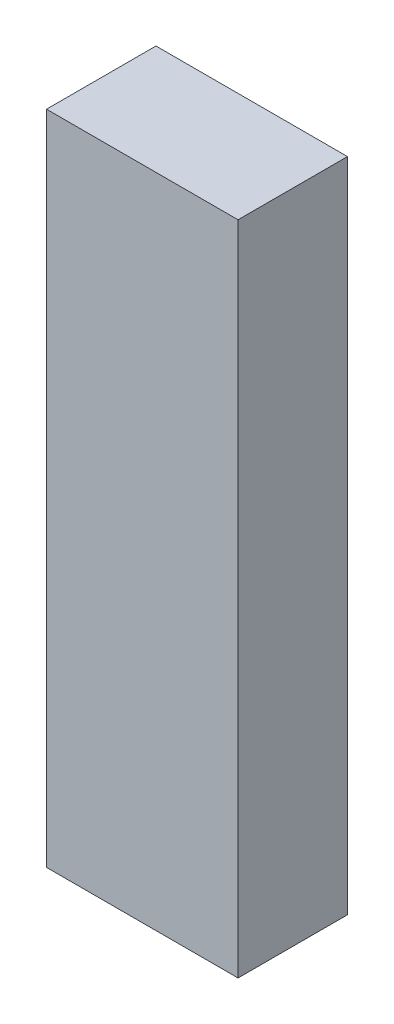
ISO-10303-21;
HEADER;
FILE_DESCRIPTION(('STEP AP214'),'2;1');
FILE_NAME('part.step','',(''),(''),'','','');
FILE_SCHEMA(('AUTOMOTIVE_DESIGN { 1 0 10303 214 1 1 1 1 }'));
ENDSEC;
DATA;
#1=APPLICATION_CONTEXT('core data for automotive mechanical design processes');
#2=APPLICATION_PROTOCOL_DEFINITION('international standard','automotive_design',2000,#1);
#3=PRODUCT_CONTEXT('',#1,'mechanical');
#4=PRODUCT('Part','Part','',(#3));
#5=PRODUCT_RELATED_PRODUCT_CATEGORY('part','',(#4));
#6=PRODUCT_DEFINITION_FORMATION('','',#4);
#7=PRODUCT_DEFINITION_CONTEXT('part definition',#1,'design');
#8=PRODUCT_DEFINITION('design','',#6,#7);
#9=PRODUCT_DEFINITION_SHAPE('','',#8);
#10=(LENGTH_UNIT() NAMED_UNIT(*) SI_UNIT(.MILLI.,.METRE.));
#11=(NAMED_UNIT(*) PLANE_ANGLE_UNIT() SI_UNIT($,.RADIAN.));
#12=(NAMED_UNIT(*) SI_UNIT($,.STERADIAN.) SOLID_ANGLE_UNIT());
#13=UNCERTAINTY_MEASURE_WITH_UNIT(LENGTH_MEASURE(1.E-05),#10,'distance_accuracy_value','');
#14=(GEOMETRIC_REPRESENTATION_CONTEXT(3) GLOBAL_UNCERTAINTY_ASSIGNED_CONTEXT((#13)) GLOBAL_UNIT_ASSIGNED_CONTEXT((#10,
#11,#12)) REPRESENTATION_CONTEXT('',''));
#15=CARTESIAN_POINT('',(0.,0.,0.));
#16=DIRECTION('',(0.,0.,1.));
#17=DIRECTION('',(1.,0.,0.));
#18=AXIS2_PLACEMENT_3D('',#15,#16,#17);
#19=CARTESIAN_POINT('',(-7.,24.,4.));
#20=DIRECTION('',(1.,0.,0.));
#21=DIRECTION('',(0.,0.,-1.));
#22=AXIS2_PLACEMENT_3D('',#19,#20,#21);
#23=PLANE('',#22);
#24=DIRECTION('',(0.,-1.,0.));
#25=VECTOR('',#24,1.);
#26=CARTESIAN_POINT('',(-7.,24.,-4.));
#27=LINE('',#26,#25);
#28=CARTESIAN_POINT('',(-7.,24.,-4.));
#29=VERTEX_POINT('',#28);
#30=CARTESIAN_POINT('',(-7.,-24.,-4.));
#31=VERTEX_POINT('',#30);
#32=EDGE_CURVE('E100',#29,#31,#27,.T.);
#33=ORIENTED_EDGE('',*,*,#32,.T.);
#34=DIRECTION('',(0.,0.,-1.));
#35=VECTOR('',#34,1.);
#36=CARTESIAN_POINT('',(-7.,-24.,4.));
#37=LINE('',#36,#35);
#38=CARTESIAN_POINT('',(-7.,-24.,4.));
#39=VERTEX_POINT('',#38);
#40=EDGE_CURVE('E11',#39,#31,#37,.T.);
#41=ORIENTED_EDGE('',*,*,#40,.F.);
#42=DIRECTION('',(0.,-1.,0.));
#43=VECTOR('',#42,1.);
#44=CARTESIAN_POINT('',(-7.,24.,4.));
#45=LINE('',#44,#43);
#46=CARTESIAN_POINT('',(-7.,24.,4.));
#47=VERTEX_POINT('',#46);
#48=EDGE_CURVE('E88',#47,#39,#45,.T.);
#49=ORIENTED_EDGE('',*,*,#48,.F.);
#50=DIRECTION('',(0.,0.,-1.));
#51=VECTOR('',#50,1.);
#52=CARTESIAN_POINT('',(-7.,24.,4.));
#53=LINE('',#52,#51);
#54=EDGE_CURVE('E96',#47,#29,#53,.T.);
#55=ORIENTED_EDGE('',*,*,#54,.T.);
#56=EDGE_LOOP('',(#33,#41,#49,#55));
#57=FACE_BOUND('',#56,.T.);
#58=ADVANCED_FACE('F37',(#57),#23,.F.);
#59=CARTESIAN_POINT('',(-7.,-24.,4.));
#60=DIRECTION('',(0.,1.,0.));
#61=DIRECTION('',(0.,0.,1.));
#62=AXIS2_PLACEMENT_3D('',#59,#60,#61);
#63=PLANE('',#62);
#64=DIRECTION('',(1.,0.,0.));
#65=VECTOR('',#64,1.);
#66=CARTESIAN_POINT('',(-7.,-24.,-4.));
#67=LINE('',#66,#65);
#68=CARTESIAN_POINT('',(7.,-24.,-4.));
#69=VERTEX_POINT('',#68);
#70=EDGE_CURVE('E92',#31,#69,#67,.T.);
#71=ORIENTED_EDGE('',*,*,#70,.T.);
#72=DIRECTION('',(0.,0.,-1.));
#73=VECTOR('',#72,1.);
#74=CARTESIAN_POINT('',(7.,-24.,4.));
#75=LINE('',#74,#73);
#76=CARTESIAN_POINT('',(7.,-24.,4.));
#77=VERTEX_POINT('',#76);
#78=EDGE_CURVE('E45',#77,#69,#75,.T.);
#79=ORIENTED_EDGE('',*,*,#78,.F.);
#80=DIRECTION('',(1.,0.,0.));
#81=VECTOR('',#80,1.);
#82=CARTESIAN_POINT('',(-7.,-24.,4.));
#83=LINE('',#82,#81);
#84=EDGE_CURVE('E83',#39,#77,#83,.T.);
#85=ORIENTED_EDGE('',*,*,#84,.F.);
#86=ORIENTED_EDGE('',*,*,#40,.T.);
#87=EDGE_LOOP('',(#71,#79,#85,#86));
#88=FACE_BOUND('',#87,.T.);
#89=ADVANCED_FACE('F91',(#88),#63,.F.);
#90=CARTESIAN_POINT('',(7.,24.,4.));
#91=DIRECTION('',(-1.,0.,0.));
#92=DIRECTION('',(0.,-1.,0.));
#93=AXIS2_PLACEMENT_3D('',#90,#91,#92);
#94=PLANE('',#93);
#95=DIRECTION('',(0.,1.,0.));
#96=VECTOR('',#95,1.);
#97=CARTESIAN_POINT('',(7.,24.,-4.));
#98=LINE('',#97,#96);
#99=CARTESIAN_POINT('',(7.,24.,-4.));
#100=VERTEX_POINT('',#99);
#101=EDGE_CURVE('E70',#69,#100,#98,.T.);
#102=ORIENTED_EDGE('',*,*,#101,.T.);
#103=DIRECTION('',(0.,0.,-1.));
#104=VECTOR('',#103,1.);
#105=CARTESIAN_POINT('',(7.,24.,4.));
#106=LINE('',#105,#104);
#107=CARTESIAN_POINT('',(7.,24.,4.));
#108=VERTEX_POINT('',#107);
#109=EDGE_CURVE('E93',#108,#100,#106,.T.);
#110=ORIENTED_EDGE('',*,*,#109,.F.);
#111=DIRECTION('',(0.,1.,0.));
#112=VECTOR('',#111,1.);
#113=CARTESIAN_POINT('',(7.,24.,4.));
#114=LINE('',#113,#112);
#115=EDGE_CURVE('E86',#77,#108,#114,.T.);
#116=ORIENTED_EDGE('',*,*,#115,.F.);
#117=ORIENTED_EDGE('',*,*,#78,.T.);
#118=EDGE_LOOP('',(#102,#110,#116,#117));
#119=FACE_BOUND('',#118,.T.);
#120=ADVANCED_FACE('F94',(#119),#94,.F.);
#121=CARTESIAN_POINT('',(-7.,24.,4.));
#122=DIRECTION('',(0.,-1.,0.));
#123=DIRECTION('',(0.,0.,-1.));
#124=AXIS2_PLACEMENT_3D('',#121,#122,#123);
#125=PLANE('',#124);
#126=DIRECTION('',(-1.,0.,0.));
#127=VECTOR('',#126,1.);
#128=CARTESIAN_POINT('',(-7.,24.,-4.));
#129=LINE('',#128,#127);
#130=EDGE_CURVE('E76',#100,#29,#129,.T.);
#131=ORIENTED_EDGE('',*,*,#130,.T.);
#132=ORIENTED_EDGE('',*,*,#54,.F.);
#133=DIRECTION('',(-1.,0.,0.));
#134=VECTOR('',#133,1.);
#135=CARTESIAN_POINT('',(-7.,24.,4.));
#136=LINE('',#135,#134);
#137=EDGE_CURVE('E53',#108,#47,#136,.T.);
#138=ORIENTED_EDGE('',*,*,#137,.F.);
#139=ORIENTED_EDGE('',*,*,#109,.T.);
#140=EDGE_LOOP('',(#131,#132,#138,#139));
#141=FACE_BOUND('',#140,.T.);
#142=ADVANCED_FACE('F107',(#141),#125,.F.);
#143=CARTESIAN_POINT('',(0.,0.,4.));
#144=DIRECTION('',(0.,0.,1.));
#145=DIRECTION('',(1.,0.,0.));
#146=AXIS2_PLACEMENT_3D('',#143,#144,#145);
#147=PLANE('',#146);
#148=ORIENTED_EDGE('',*,*,#48,.T.);
#149=ORIENTED_EDGE('',*,*,#84,.T.);
#150=ORIENTED_EDGE('',*,*,#115,.T.);
#151=ORIENTED_EDGE('',*,*,#137,.T.);
#152=EDGE_LOOP('',(#148,#149,#150,#151));
#153=FACE_BOUND('',#152,.T.);
#154=ADVANCED_FACE('F84',(#153),#147,.T.);
#155=CARTESIAN_POINT('',(0.,0.,-4.));
#156=DIRECTION('',(0.,0.,1.));
#157=DIRECTION('',(1.,0.,0.));
#158=AXIS2_PLACEMENT_3D('',#155,#156,#157);
#159=PLANE('',#158);
#160=ORIENTED_EDGE('',*,*,#32,.F.);
#161=ORIENTED_EDGE('',*,*,#130,.F.);
#162=ORIENTED_EDGE('',*,*,#101,.F.);
#163=ORIENTED_EDGE('',*,*,#70,.F.);
#164=EDGE_LOOP('',(#160,#161,#162,#163));
#165=FACE_BOUND('',#164,.T.);
#166=ADVANCED_FACE('F110',(#165),#159,.F.);
#167=CLOSED_SHELL('',(#58,#89,#120,#142,#154,#166));
#168=MANIFOLD_SOLID_BREP('B2',#167);
#169=ADVANCED_BREP_SHAPE_REPRESENTATION('',(#18,#168),#14);
#170=SHAPE_DEFINITION_REPRESENTATION(#9,#169);
ENDSEC;
END-ISO-10303-21;
